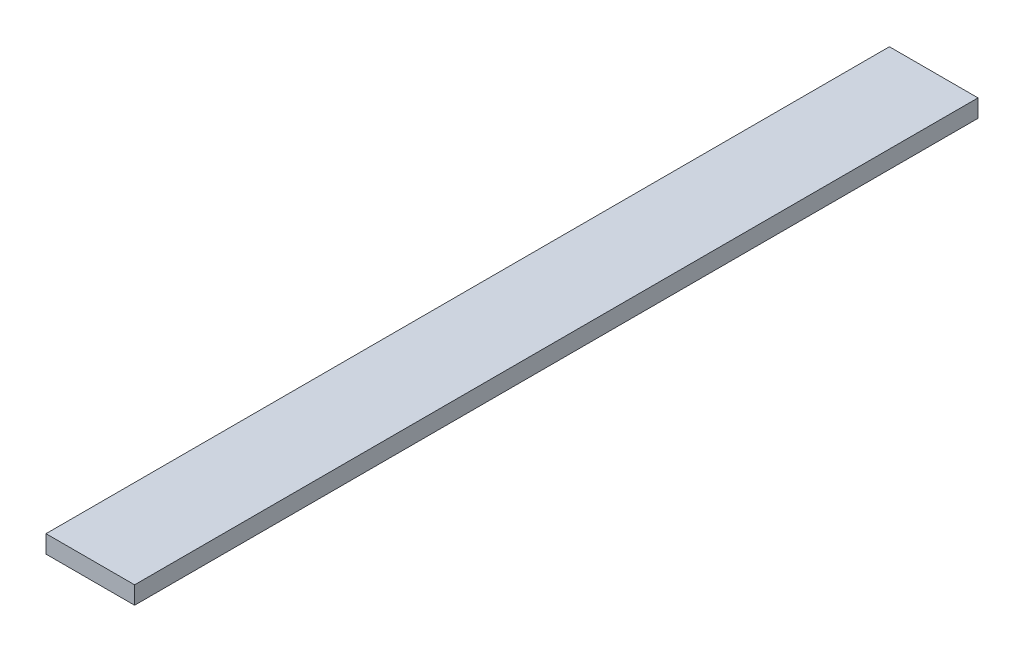
ISO-10303-21;
HEADER;
FILE_DESCRIPTION(('STEP AP214'),'2;1');
FILE_NAME('part.step','',(''),(''),'','','');
FILE_SCHEMA(('AUTOMOTIVE_DESIGN { 1 0 10303 214 1 1 1 1 }'));
ENDSEC;
DATA;
#1=APPLICATION_CONTEXT('core data for automotive mechanical design processes');
#2=APPLICATION_PROTOCOL_DEFINITION('international standard','automotive_design',2000,#1);
#3=PRODUCT_CONTEXT('',#1,'mechanical');
#4=PRODUCT('Part','Part','',(#3));
#5=PRODUCT_RELATED_PRODUCT_CATEGORY('part','',(#4));
#6=PRODUCT_DEFINITION_FORMATION('','',#4);
#7=PRODUCT_DEFINITION_CONTEXT('part definition',#1,'design');
#8=PRODUCT_DEFINITION('design','',#6,#7);
#9=PRODUCT_DEFINITION_SHAPE('','',#8);
#10=(LENGTH_UNIT() NAMED_UNIT(*) SI_UNIT(.MILLI.,.METRE.));
#11=(NAMED_UNIT(*) PLANE_ANGLE_UNIT() SI_UNIT($,.RADIAN.));
#12=(NAMED_UNIT(*) SI_UNIT($,.STERADIAN.) SOLID_ANGLE_UNIT());
#13=UNCERTAINTY_MEASURE_WITH_UNIT(LENGTH_MEASURE(1.E-05),#10,'distance_accuracy_value','');
#14=(GEOMETRIC_REPRESENTATION_CONTEXT(3) GLOBAL_UNCERTAINTY_ASSIGNED_CONTEXT((#13)) GLOBAL_UNIT_ASSIGNED_CONTEXT((#10,
#11,#12)) REPRESENTATION_CONTEXT('',''));
#15=CARTESIAN_POINT('',(0.,0.,0.));
#16=DIRECTION('',(0.,0.,1.));
#17=DIRECTION('',(1.,0.,0.));
#18=AXIS2_PLACEMENT_3D('',#15,#16,#17);
#19=CARTESIAN_POINT('',(0.,2.02999999999,0.));
#20=DIRECTION('',(0.,1.,0.));
#21=DIRECTION('',(-1.,0.,0.));
#22=AXIS2_PLACEMENT_3D('',#19,#20,#21);
#23=PLANE('',#22);
#24=DIRECTION('',(-1.,0.,0.));
#25=VECTOR('',#24,1.);
#26=CARTESIAN_POINT('',(0.,2.02999999999,0.195));
#27=LINE('',#26,#25);
#28=CARTESIAN_POINT('',(-1.125,2.02999999999,0.195));
#29=VERTEX_POINT('',#28);
#30=CARTESIAN_POINT('',(-1.375,2.02999999999,0.195));
#31=VERTEX_POINT('',#30);
#32=EDGE_CURVE('E19',#29,#31,#27,.T.);
#33=ORIENTED_EDGE('',*,*,#32,.F.);
#34=DIRECTION('',(0.,0.,1.));
#35=VECTOR('',#34,1.);
#36=CARTESIAN_POINT('',(-1.125,2.02999999999,0.195));
#37=LINE('',#36,#35);
#38=CARTESIAN_POINT('',(-1.125,2.02999999999,2.575));
#39=VERTEX_POINT('',#38);
#40=EDGE_CURVE('E68',#29,#39,#37,.T.);
#41=ORIENTED_EDGE('',*,*,#40,.T.);
#42=DIRECTION('',(-1.,0.,0.));
#43=VECTOR('',#42,1.);
#44=CARTESIAN_POINT('',(-1.375,2.02999999999,2.575));
#45=LINE('',#44,#43);
#46=CARTESIAN_POINT('',(-1.375,2.02999999999,2.575));
#47=VERTEX_POINT('',#46);
#48=EDGE_CURVE('E55',#39,#47,#45,.T.);
#49=ORIENTED_EDGE('',*,*,#48,.T.);
#50=DIRECTION('',(0.,0.,1.));
#51=VECTOR('',#50,1.);
#52=CARTESIAN_POINT('',(-1.375,2.02999999999,0.195));
#53=LINE('',#52,#51);
#54=EDGE_CURVE('E61',#47,#31,#53,.F.);
#55=ORIENTED_EDGE('',*,*,#54,.T.);
#56=EDGE_LOOP('',(#33,#41,#49,#55));
#57=FACE_BOUND('',#56,.T.);
#58=ADVANCED_FACE('F16',(#57),#23,.F.);
#59=CARTESIAN_POINT('',(-1.375,2.07999999999,0.195));
#60=DIRECTION('',(1.,0.,0.));
#61=DIRECTION('',(0.,1.,0.));
#62=AXIS2_PLACEMENT_3D('',#59,#60,#61);
#63=PLANE('',#62);
#64=DIRECTION('',(0.,1.,0.));
#65=VECTOR('',#64,1.);
#66=CARTESIAN_POINT('',(-1.375,2.07999999999,2.575));
#67=LINE('',#66,#65);
#68=CARTESIAN_POINT('',(-1.375,2.07999999999,2.575));
#69=VERTEX_POINT('',#68);
#70=EDGE_CURVE('E63',#47,#69,#67,.T.);
#71=ORIENTED_EDGE('',*,*,#70,.T.);
#72=DIRECTION('',(0.,0.,1.));
#73=VECTOR('',#72,1.);
#74=CARTESIAN_POINT('',(-1.375,2.07999999999,0.));
#75=LINE('',#74,#73);
#76=CARTESIAN_POINT('',(-1.375,2.07999999999,0.195));
#77=VERTEX_POINT('',#76);
#78=EDGE_CURVE('E82',#77,#69,#75,.T.);
#79=ORIENTED_EDGE('',*,*,#78,.F.);
#80=DIRECTION('',(0.,1.,0.));
#81=VECTOR('',#80,1.);
#82=CARTESIAN_POINT('',(-1.375,2.07999999999,0.195));
#83=LINE('',#82,#81);
#84=EDGE_CURVE('E66',#77,#31,#83,.F.);
#85=ORIENTED_EDGE('',*,*,#84,.T.);
#86=ORIENTED_EDGE('',*,*,#54,.F.);
#87=EDGE_LOOP('',(#71,#79,#85,#86));
#88=FACE_BOUND('',#87,.T.);
#89=ADVANCED_FACE('F62',(#88),#63,.F.);
#90=CARTESIAN_POINT('',(-1.375,2.07999999999,2.575));
#91=DIRECTION('',(0.,0.,-1.));
#92=DIRECTION('',(-1.,0.,0.));
#93=AXIS2_PLACEMENT_3D('',#90,#91,#92);
#94=PLANE('',#93);
#95=DIRECTION('',(0.,-1.,0.));
#96=VECTOR('',#95,1.);
#97=CARTESIAN_POINT('',(-1.125,2.07999999999,2.575));
#98=LINE('',#97,#96);
#99=CARTESIAN_POINT('',(-1.125,2.07999999999,2.575));
#100=VERTEX_POINT('',#99);
#101=EDGE_CURVE('E70',#39,#100,#98,.F.);
#102=ORIENTED_EDGE('',*,*,#101,.T.);
#103=DIRECTION('',(-1.,0.,0.));
#104=VECTOR('',#103,1.);
#105=CARTESIAN_POINT('',(0.,2.07999999999,2.575));
#106=LINE('',#105,#104);
#107=EDGE_CURVE('E74',#69,#100,#106,.F.);
#108=ORIENTED_EDGE('',*,*,#107,.F.);
#109=ORIENTED_EDGE('',*,*,#70,.F.);
#110=ORIENTED_EDGE('',*,*,#48,.F.);
#111=EDGE_LOOP('',(#102,#108,#109,#110));
#112=FACE_BOUND('',#111,.T.);
#113=ADVANCED_FACE('F72',(#112),#94,.F.);
#114=CARTESIAN_POINT('',(-1.125,2.07999999999,0.195));
#115=DIRECTION('',(-1.,0.,0.));
#116=DIRECTION('',(0.,-1.,0.));
#117=AXIS2_PLACEMENT_3D('',#114,#115,#116);
#118=PLANE('',#117);
#119=DIRECTION('',(0.,1.,0.));
#120=VECTOR('',#119,1.);
#121=CARTESIAN_POINT('',(-1.125,2.07999999999,0.195));
#122=LINE('',#121,#120);
#123=CARTESIAN_POINT('',(-1.125,2.07999999999,0.195));
#124=VERTEX_POINT('',#123);
#125=EDGE_CURVE('E34',#29,#124,#122,.T.);
#126=ORIENTED_EDGE('',*,*,#125,.T.);
#127=DIRECTION('',(0.,0.,1.));
#128=VECTOR('',#127,1.);
#129=CARTESIAN_POINT('',(-1.125,2.07999999999,0.));
#130=LINE('',#129,#128);
#131=EDGE_CURVE('E25',#100,#124,#130,.F.);
#132=ORIENTED_EDGE('',*,*,#131,.F.);
#133=ORIENTED_EDGE('',*,*,#101,.F.);
#134=ORIENTED_EDGE('',*,*,#40,.F.);
#135=EDGE_LOOP('',(#126,#132,#133,#134));
#136=FACE_BOUND('',#135,.T.);
#137=ADVANCED_FACE('F88',(#136),#118,.F.);
#138=CARTESIAN_POINT('',(-1.375,2.07999999999,0.195));
#139=DIRECTION('',(0.,0.,1.));
#140=DIRECTION('',(1.,0.,0.));
#141=AXIS2_PLACEMENT_3D('',#138,#139,#140);
#142=PLANE('',#141);
#143=ORIENTED_EDGE('',*,*,#84,.F.);
#144=DIRECTION('',(-1.,0.,0.));
#145=VECTOR('',#144,1.);
#146=CARTESIAN_POINT('',(0.,2.07999999999,0.195));
#147=LINE('',#146,#145);
#148=EDGE_CURVE('E11',#124,#77,#147,.T.);
#149=ORIENTED_EDGE('',*,*,#148,.F.);
#150=ORIENTED_EDGE('',*,*,#125,.F.);
#151=ORIENTED_EDGE('',*,*,#32,.T.);
#152=EDGE_LOOP('',(#143,#149,#150,#151));
#153=FACE_BOUND('',#152,.T.);
#154=ADVANCED_FACE('F90',(#153),#142,.F.);
#155=CARTESIAN_POINT('',(0.,2.07999999999,0.));
#156=DIRECTION('',(0.,1.,0.));
#157=DIRECTION('',(-1.,0.,0.));
#158=AXIS2_PLACEMENT_3D('',#155,#156,#157);
#159=PLANE('',#158);
#160=ORIENTED_EDGE('',*,*,#131,.T.);
#161=ORIENTED_EDGE('',*,*,#148,.T.);
#162=ORIENTED_EDGE('',*,*,#78,.T.);
#163=ORIENTED_EDGE('',*,*,#107,.T.);
#164=EDGE_LOOP('',(#160,#161,#162,#163));
#165=FACE_BOUND('',#164,.T.);
#166=ADVANCED_FACE('F87',(#165),#159,.T.);
#167=CLOSED_SHELL('',(#58,#89,#113,#137,#154,#166));
#168=MANIFOLD_SOLID_BREP('B1',#167);
#169=ADVANCED_BREP_SHAPE_REPRESENTATION('',(#18,#168),#14);
#170=SHAPE_DEFINITION_REPRESENTATION(#9,#169);
ENDSEC;
END-ISO-10303-21;
